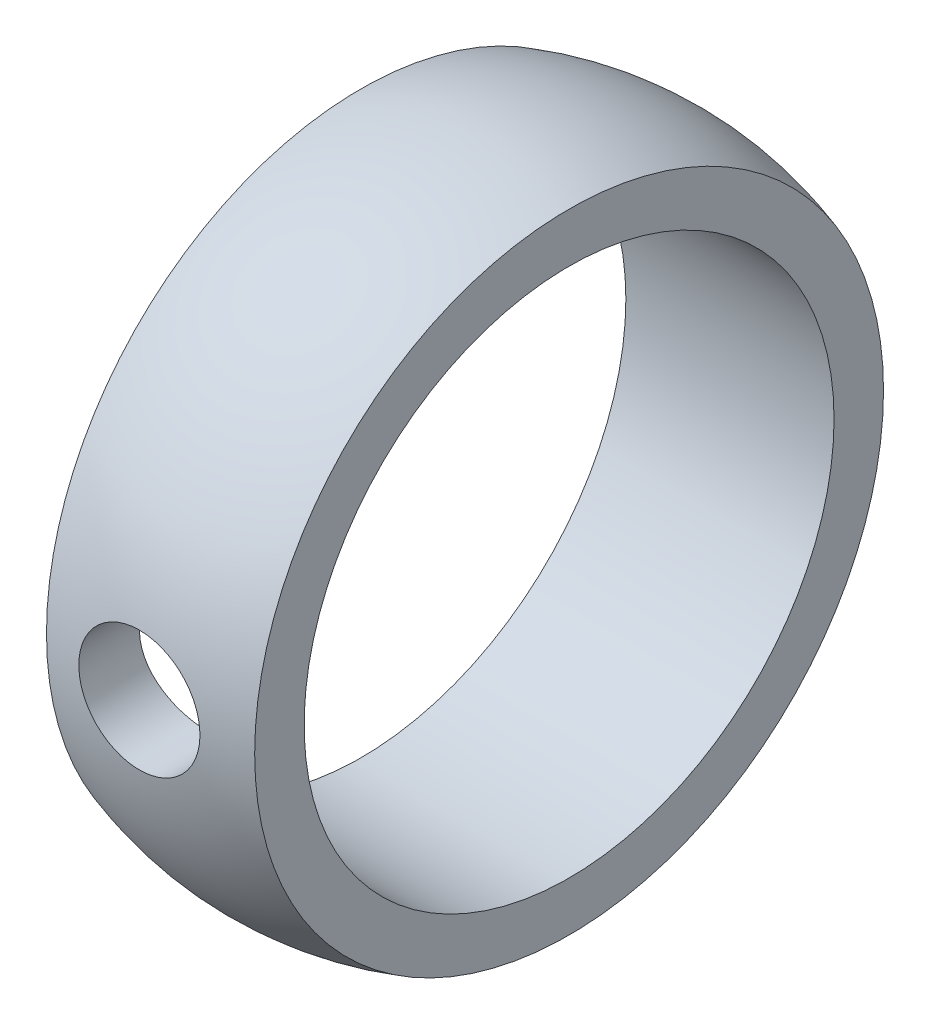
ISO-10303-21;
HEADER;
FILE_DESCRIPTION(('STEP AP214'),'2;1');
FILE_NAME('part.step','',(''),(''),'','','');
FILE_SCHEMA(('AUTOMOTIVE_DESIGN { 1 0 10303 214 1 1 1 1 }'));
ENDSEC;
DATA;
#1=APPLICATION_CONTEXT('core data for automotive mechanical design processes');
#2=APPLICATION_PROTOCOL_DEFINITION('international standard','automotive_design',2000,#1);
#3=PRODUCT_CONTEXT('',#1,'mechanical');
#4=PRODUCT('Part','Part','',(#3));
#5=PRODUCT_RELATED_PRODUCT_CATEGORY('part','',(#4));
#6=PRODUCT_DEFINITION_FORMATION('','',#4);
#7=PRODUCT_DEFINITION_CONTEXT('part definition',#1,'design');
#8=PRODUCT_DEFINITION('design','',#6,#7);
#9=PRODUCT_DEFINITION_SHAPE('','',#8);
#10=(LENGTH_UNIT() NAMED_UNIT(*) SI_UNIT(.MILLI.,.METRE.));
#11=(NAMED_UNIT(*) PLANE_ANGLE_UNIT() SI_UNIT($,.RADIAN.));
#12=(NAMED_UNIT(*) SI_UNIT($,.STERADIAN.) SOLID_ANGLE_UNIT());
#13=UNCERTAINTY_MEASURE_WITH_UNIT(LENGTH_MEASURE(1.E-05),#10,'distance_accuracy_value','');
#14=(GEOMETRIC_REPRESENTATION_CONTEXT(3) GLOBAL_UNCERTAINTY_ASSIGNED_CONTEXT((#13)) GLOBAL_UNIT_ASSIGNED_CONTEXT((#10,
#11,#12)) REPRESENTATION_CONTEXT('',''));
#15=CARTESIAN_POINT('',(0.,0.,0.));
#16=DIRECTION('',(0.,0.,1.));
#17=DIRECTION('',(1.,0.,0.));
#18=AXIS2_PLACEMENT_3D('',#15,#16,#17);
#19=CARTESIAN_POINT('',(129.,109.,97.1));
#20=DIRECTION('',(1.,0.,0.));
#21=DIRECTION('',(0.,0.,-1.));
#22=AXIS2_PLACEMENT_3D('',#19,#20,#21);
#23=CYLINDRICAL_SURFACE('',#22,14.);
#24=CARTESIAN_POINT('',(123.5,109.,97.1));
#25=DIRECTION('',(1.,0.,0.));
#26=DIRECTION('',(0.,0.,-1.));
#27=AXIS2_PLACEMENT_3D('',#24,#25,#26);
#28=CIRCLE('',#27,14.);
#29=CARTESIAN_POINT('',(123.5,109.,83.1));
#30=VERTEX_POINT('',#29);
#31=EDGE_CURVE('E39',#30,#30,#28,.T.);
#32=ORIENTED_EDGE('',*,*,#31,.F.);
#33=EDGE_LOOP('',(#32));
#34=FACE_BOUND('',#33,.T.);
#35=CARTESIAN_POINT('',(129.,112.2,110.729380029921));
#36=CARTESIAN_POINT('',(128.822649143116,112.200004759689,110.729377147929));
#37=CARTESIAN_POINT('',(128.645336292038,112.185219036723,110.732875316908));
#38=CARTESIAN_POINT('',(128.295878569033,112.126593225702,110.746439667084));
#39=CARTESIAN_POINT('',(128.123732465931,112.082760117676,110.756504270372));
#40=CARTESIAN_POINT('',(127.789542960265,111.967494468207,110.782011042222));
#41=CARTESIAN_POINT('',(127.627491936923,111.89608304618,110.797449094917));
#42=CARTESIAN_POINT('',(127.317635250112,111.727772579523,110.831955709846));
#43=CARTESIAN_POINT('',(127.169831594974,111.630869948769,110.851024782791));
#44=CARTESIAN_POINT('',(126.88999478502,111.412446441267,110.891033274204));
#45=CARTESIAN_POINT('',(126.758260219319,111.290547680648,110.911998249571));
#46=CARTESIAN_POINT('',(126.516893759843,111.026376001779,110.953217634314));
#47=CARTESIAN_POINT('',(126.407267645754,110.884097772425,110.97347185674));
#48=CARTESIAN_POINT('',(126.212015864975,110.58114317015,111.011274102871));
#49=CARTESIAN_POINT('',(126.1266930578,110.420267032194,111.028786847293));
#50=CARTESIAN_POINT('',(125.984492106982,110.08609686274,111.05881147727));
#51=CARTESIAN_POINT('',(125.927581440081,109.912817290507,111.071329077433));
#52=CARTESIAN_POINT('',(125.857319439215,109.61554268646,111.086983644029));
#53=CARTESIAN_POINT('',(125.835860000743,109.493492680475,111.091839990944));
#54=CARTESIAN_POINT('',(125.80719778093,109.247645385557,111.098349618411));
#55=CARTESIAN_POINT('',(125.799994620863,109.123848143129,111.100002984053));
#56=CARTESIAN_POINT('',(125.800007697527,108.822773718929,111.09999572983));
#57=CARTESIAN_POINT('',(125.814776691911,108.645443205872,111.096599667114));
#58=CARTESIAN_POINT('',(125.873407344885,108.295793673793,111.083375687095));
#59=CARTESIAN_POINT('',(125.917297872048,108.123479804957,111.073541387609));
#60=CARTESIAN_POINT('',(126.032713394948,107.789024951131,111.04853524767));
#61=CARTESIAN_POINT('',(126.104204671795,107.62687183296,111.033369921963));
#62=CARTESIAN_POINT('',(126.272688383808,107.316877475368,110.999332636441));
#63=CARTESIAN_POINT('',(126.369678915486,107.169035168791,110.980460953325));
#64=CARTESIAN_POINT('',(126.588201164693,106.889260346341,110.940703729876));
#65=CARTESIAN_POINT('',(126.710093345755,106.757613171038,110.919791284907));
#66=CARTESIAN_POINT('',(126.974186735787,106.516441253062,110.878495590097));
#67=CARTESIAN_POINT('',(127.116390113595,106.406918875903,110.858112397045));
#68=CARTESIAN_POINT('',(127.419205308738,106.211826113933,110.819916950038));
#69=CARTESIAN_POINT('',(127.580020108297,106.126563469437,110.802139006032));
#70=CARTESIAN_POINT('',(127.914169627363,105.984386104383,110.771554298285));
#71=CARTESIAN_POINT('',(128.087502687888,105.927467635378,110.758746877254));
#72=CARTESIAN_POINT('',(128.438665557835,105.844544771097,110.739827635854));
#73=CARTESIAN_POINT('',(128.616369673569,105.818033644405,110.733606201094));
#74=CARTESIAN_POINT('',(128.973803738321,105.795101540208,110.728234489275));
#75=CARTESIAN_POINT('',(129.15353341034,105.798676497068,110.729083256794));
#76=CARTESIAN_POINT('',(129.506115109495,105.835408306095,110.73765700748));
#77=CARTESIAN_POINT('',(129.679032796759,105.867972004748,110.745244106922));
#78=CARTESIAN_POINT('',(130.016883900927,105.960815265551,110.766221132108));
#79=CARTESIAN_POINT('',(130.181816830106,106.021096518387,110.779611411826));
#80=CARTESIAN_POINT('',(130.500660709827,106.168196417318,110.81081909443));
#81=CARTESIAN_POINT('',(130.654464443061,106.255239249426,110.828673649818));
#82=CARTESIAN_POINT('',(130.945500235111,106.453234097636,110.866775895256));
#83=CARTESIAN_POINT('',(131.082729838434,106.564189649693,110.887023939029));
#84=CARTESIAN_POINT('',(131.340132364195,106.809979934566,110.928220036265));
#85=CARTESIAN_POINT('',(131.459824400966,106.945317934996,110.949173311659));
#86=CARTESIAN_POINT('',(131.674895646007,107.234387568605,110.988983620023));
#87=CARTESIAN_POINT('',(131.770274321868,107.388119604464,111.007840607084));
#88=CARTESIAN_POINT('',(131.934147286218,107.710230126413,111.04140400944));
#89=CARTESIAN_POINT('',(132.002574026266,107.878644136599,111.056099970576));
#90=CARTESIAN_POINT('',(132.110019768742,108.224991683932,111.079608413439));
#91=CARTESIAN_POINT('',(132.149043475868,108.402923693248,111.088421836389));
#92=CARTESIAN_POINT('',(132.195865573062,108.759135735585,111.099037331546));
#93=CARTESIAN_POINT('',(132.204320224187,108.937325235034,111.100986737188));
#94=CARTESIAN_POINT('',(132.191549355789,109.292571082013,111.098069455552));
#95=CARTESIAN_POINT('',(132.170326020727,109.46962751198,111.093203269937));
#96=CARTESIAN_POINT('',(132.099345037509,109.815374139364,111.077295019431));
#97=CARTESIAN_POINT('',(132.049935864134,109.984139659734,111.066328417297));
#98=CARTESIAN_POINT('',(131.924375626184,110.310986092417,111.039448722768));
#99=CARTESIAN_POINT('',(131.848221992596,110.469065976553,111.023535155195));
#100=CARTESIAN_POINT('',(131.669993789653,110.772739359036,110.988165698993));
#101=CARTESIAN_POINT('',(131.567538491586,110.918103366143,110.968659083576));
#102=CARTESIAN_POINT('',(131.340119793828,111.189802445249,110.928364400237));
#103=CARTESIAN_POINT('',(131.215154347016,111.316135784636,110.907576215879));
#104=CARTESIAN_POINT('',(130.943246613265,111.548811670334,110.866547398828));
#105=CARTESIAN_POINT('',(130.795912612266,111.654700671166,110.846326208674));
#106=CARTESIAN_POINT('',(130.485143709315,111.840266973889,110.809189277237));
#107=CARTESIAN_POINT('',(130.321704811107,111.919937748621,110.792274359494));
#108=CARTESIAN_POINT('',(129.969520721123,112.055888262637,110.762607145224));
#109=CARTESIAN_POINT('',(129.779797946608,112.10975360501,110.750302429871));
#110=CARTESIAN_POINT('',(129.393366859948,112.181802986525,110.733691332717));
#111=CARTESIAN_POINT('',(129.196660063901,112.199994722097,110.729383225691));
#112=CARTESIAN_POINT('',(129.,112.2,110.729380029921));
#113=B_SPLINE_CURVE_WITH_KNOTS('',3,(#35,#36,#37,#38,#39,#40,#41,#42,#43,#44,#45,#46,#47,#48,
#49,#50,#51,#52,#53,#54,#55,#56,#57,#58,#59,#60,#61,#62,#63,#64,#65,#66,#67,#68,#69,#70,#71,#72,
#73,#74,#75,#76,#77,#78,#79,#80,#81,#82,#83,#84,#85,#86,#87,#88,#89,#90,#91,#92,#93,#94,#95,#96,
#97,#98,#99,#100,#101,#102,#103,#104,#105,#106,#107,#108,#109,#110,#111,#112),.UNSPECIFIED.,.T.,
.F.,(4,2,2,2,2,2,2,2,2,2,2,2,2,2,2,2,2,2,2,2,2,2,2,2,2,2,2,2,2,2,2,2,2,2,2,2,2,2,4),(0.,
0.531346344699087,1.06256505421482,1.59337776165895,2.12426518424235,2.6638643005602,
3.20360429882425,3.74980228521561,4.29537359921685,4.66660811513382,5.03783276889324,
5.56905401424509,6.1008026548451,6.63190372155515,7.16296515350167,7.70234137987499,
8.24177524418372,8.78777449137069,9.33370151230761,9.87039219621845,10.4070103564179,
10.9328946076233,11.4588109404003,11.9892588743558,12.5197852991181,13.0628753329729,
13.6059772582873,14.1504318043543,14.6947992152436,15.2274082696068,15.7599781231015,
16.286102006085,16.8122764411872,17.3465451895098,17.8808625499609,18.4259344065777,
18.971141859101,19.5604660921778,20.1496631670479),.UNSPECIFIED.);
#114=CARTESIAN_POINT('',(129.,112.2,110.729380029921));
#115=VERTEX_POINT('',#114);
#116=EDGE_CURVE('E18',#115,#115,#113,.T.);
#117=ORIENTED_EDGE('',*,*,#116,.T.);
#118=EDGE_LOOP('',(#117));
#119=FACE_BOUND('',#118,.T.);
#120=CARTESIAN_POINT('',(134.5,109.,97.1));
#121=DIRECTION('',(1.,0.,0.));
#122=DIRECTION('',(0.,0.,-1.));
#123=AXIS2_PLACEMENT_3D('',#120,#121,#122);
#124=CIRCLE('',#123,14.);
#125=CARTESIAN_POINT('',(134.5,109.,83.1));
#126=VERTEX_POINT('',#125);
#127=EDGE_CURVE('E37',#126,#126,#124,.F.);
#128=ORIENTED_EDGE('',*,*,#127,.F.);
#129=EDGE_LOOP('',(#128));
#130=FACE_BOUND('',#129,.T.);
#131=ADVANCED_FACE('F14',(#34,#119,#130),#23,.F.);
#132=CARTESIAN_POINT('',(129.,109.,102.225));
#133=DIRECTION('',(0.,0.,-1.));
#134=DIRECTION('',(0.,1.,0.));
#135=AXIS2_PLACEMENT_3D('',#132,#133,#134);
#136=CYLINDRICAL_SURFACE('',#135,3.2);
#137=ORIENTED_EDGE('',*,*,#116,.F.);
#138=EDGE_LOOP('',(#137));
#139=FACE_BOUND('',#138,.T.);
#140=CARTESIAN_POINT('',(129.,109.,114.304941150728));
#141=DIRECTION('',(0.,0.,-1.));
#142=DIRECTION('',(0.,1.,0.));
#143=AXIS2_PLACEMENT_3D('',#140,#141,#142);
#144=CIRCLE('',#143,3.2);
#145=CARTESIAN_POINT('',(129.,112.2,114.304941150728));
#146=VERTEX_POINT('',#145);
#147=EDGE_CURVE('E30',#146,#146,#144,.T.);
#148=ORIENTED_EDGE('',*,*,#147,.F.);
#149=EDGE_LOOP('',(#148));
#150=FACE_BOUND('',#149,.T.);
#151=ADVANCED_FACE('F48',(#139,#150),#136,.F.);
#152=CARTESIAN_POINT('',(123.5,125.613247725836,97.1));
#153=DIRECTION('',(-1.,0.,0.));
#154=DIRECTION('',(0.,0.,1.));
#155=AXIS2_PLACEMENT_3D('',#152,#153,#154);
#156=PLANE('',#155);
#157=ORIENTED_EDGE('',*,*,#31,.T.);
#158=EDGE_LOOP('',(#157));
#159=FACE_BOUND('',#158,.T.);
#160=CARTESIAN_POINT('',(123.5,109.,97.1));
#161=DIRECTION('',(1.,0.,0.));
#162=DIRECTION('',(0.,0.,-1.));
#163=AXIS2_PLACEMENT_3D('',#160,#161,#162);
#164=CIRCLE('',#163,16.6132477258362);
#165=CARTESIAN_POINT('',(123.5,109.,80.4867522741638));
#166=VERTEX_POINT('',#165);
#167=EDGE_CURVE('E25',#166,#166,#164,.T.);
#168=ORIENTED_EDGE('',*,*,#167,.F.);
#169=EDGE_LOOP('',(#168));
#170=FACE_BOUND('',#169,.T.);
#171=ADVANCED_FACE('F51',(#159,#170),#156,.T.);
#172=CARTESIAN_POINT('',(134.5,123.,97.1));
#173=DIRECTION('',(1.,0.,0.));
#174=DIRECTION('',(0.,0.,-1.));
#175=AXIS2_PLACEMENT_3D('',#172,#173,#174);
#176=PLANE('',#175);
#177=ORIENTED_EDGE('',*,*,#127,.T.);
#178=EDGE_LOOP('',(#177));
#179=FACE_BOUND('',#178,.T.);
#180=CARTESIAN_POINT('',(134.5,109.,97.1));
#181=DIRECTION('',(1.,0.,0.));
#182=DIRECTION('',(0.,0.,-1.));
#183=AXIS2_PLACEMENT_3D('',#180,#181,#182);
#184=CIRCLE('',#183,16.6132477258362);
#185=CARTESIAN_POINT('',(134.5,109.,80.4867522741638));
#186=VERTEX_POINT('',#185);
#187=EDGE_CURVE('E10',#186,#186,#184,.F.);
#188=ORIENTED_EDGE('',*,*,#187,.F.);
#189=EDGE_LOOP('',(#188));
#190=FACE_BOUND('',#189,.T.);
#191=ADVANCED_FACE('F56',(#179,#190),#176,.T.);
#192=CARTESIAN_POINT('',(129.,109.,97.1));
#193=DIRECTION('',(1.,0.,0.));
#194=DIRECTION('',(0.,1.,0.));
#195=AXIS2_PLACEMENT_3D('',#192,#193,#194);
#196=SPHERICAL_SURFACE('',#195,17.5);
#197=ORIENTED_EDGE('',*,*,#167,.T.);
#198=EDGE_LOOP('',(#197));
#199=FACE_BOUND('',#198,.T.);
#200=ORIENTED_EDGE('',*,*,#147,.T.);
#201=EDGE_LOOP('',(#200));
#202=FACE_BOUND('',#201,.T.);
#203=ORIENTED_EDGE('',*,*,#187,.T.);
#204=EDGE_LOOP('',(#203));
#205=FACE_BOUND('',#204,.T.);
#206=ADVANCED_FACE('F54',(#199,#202,#205),#196,.T.);
#207=CLOSED_SHELL('',(#131,#151,#171,#191,#206));
#208=MANIFOLD_SOLID_BREP('B1',#207);
#209=ADVANCED_BREP_SHAPE_REPRESENTATION('',(#18,#208),#14);
#210=SHAPE_DEFINITION_REPRESENTATION(#9,#209);
ENDSEC;
END-ISO-10303-21;
